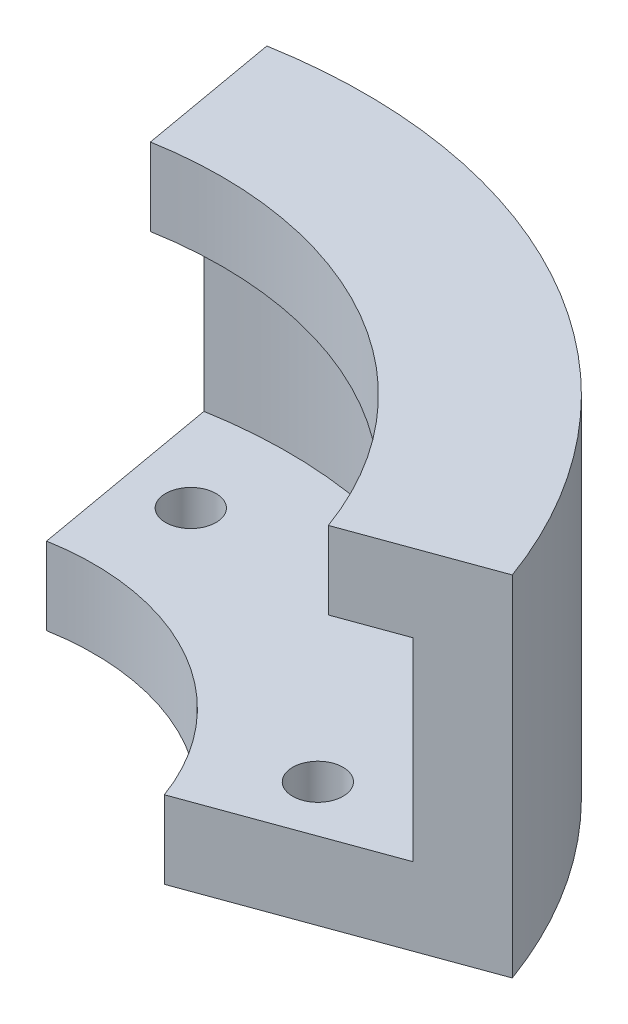
ISO-10303-21;
HEADER;
FILE_DESCRIPTION(('STEP AP214'),'2;1');
FILE_NAME('part.step','',(''),(''),'','','');
FILE_SCHEMA(('AUTOMOTIVE_DESIGN { 1 0 10303 214 1 1 1 1 }'));
ENDSEC;
DATA;
#1=APPLICATION_CONTEXT('core data for automotive mechanical design processes');
#2=APPLICATION_PROTOCOL_DEFINITION('international standard','automotive_design',2000,#1);
#3=PRODUCT_CONTEXT('',#1,'mechanical');
#4=PRODUCT('Part','Part','',(#3));
#5=PRODUCT_RELATED_PRODUCT_CATEGORY('part','',(#4));
#6=PRODUCT_DEFINITION_FORMATION('','',#4);
#7=PRODUCT_DEFINITION_CONTEXT('part definition',#1,'design');
#8=PRODUCT_DEFINITION('design','',#6,#7);
#9=PRODUCT_DEFINITION_SHAPE('','',#8);
#10=(LENGTH_UNIT() NAMED_UNIT(*) SI_UNIT(.MILLI.,.METRE.));
#11=(NAMED_UNIT(*) PLANE_ANGLE_UNIT() SI_UNIT($,.RADIAN.));
#12=(NAMED_UNIT(*) SI_UNIT($,.STERADIAN.) SOLID_ANGLE_UNIT());
#13=UNCERTAINTY_MEASURE_WITH_UNIT(LENGTH_MEASURE(1.E-05),#10,'distance_accuracy_value','');
#14=(GEOMETRIC_REPRESENTATION_CONTEXT(3) GLOBAL_UNCERTAINTY_ASSIGNED_CONTEXT((#13)) GLOBAL_UNIT_ASSIGNED_CONTEXT((#10,
#11,#12)) REPRESENTATION_CONTEXT('',''));
#15=CARTESIAN_POINT('',(0.,0.,0.));
#16=DIRECTION('',(0.,0.,1.));
#17=DIRECTION('',(1.,0.,0.));
#18=AXIS2_PLACEMENT_3D('',#15,#16,#17);
#19=CARTESIAN_POINT('',(0.,12.7,0.));
#20=DIRECTION('',(-0.342020143325673,0.,-0.939692620785907));
#21=DIRECTION('',(-0.939692620785907,0.,0.342020143325673));
#22=AXIS2_PLACEMENT_3D('',#19,#20,#21);
#23=PLANE('',#22);
#24=DIRECTION('',(0.939692620785907,0.,-0.342020143325673));
#25=VECTOR('',#24,1.);
#26=CARTESIAN_POINT('',(0.,17.78,0.));
#27=LINE('',#26,#25);
#28=CARTESIAN_POINT('',(23.271487753763,17.78,-8.47012884946029));
#29=VERTEX_POINT('',#28);
#30=CARTESIAN_POINT('',(32.1027190039089,17.78,-11.684434156435));
#31=VERTEX_POINT('',#30);
#32=EDGE_CURVE('E125',#29,#31,#27,.T.);
#33=ORIENTED_EDGE('',*,*,#32,.F.);
#34=DIRECTION('',(0.,1.,0.));
#35=VECTOR('',#34,1.);
#36=CARTESIAN_POINT('',(23.271487753763,-57.3459977443394,-8.47012884946029));
#37=LINE('',#36,#35);
#38=CARTESIAN_POINT('',(23.271487753763,12.7,-8.47012884946029));
#39=VERTEX_POINT('',#38);
#40=EDGE_CURVE('E110',#29,#39,#37,.F.);
#41=ORIENTED_EDGE('',*,*,#40,.T.);
#42=DIRECTION('',(0.939692620785907,0.,-0.342020143325673));
#43=VECTOR('',#42,1.);
#44=CARTESIAN_POINT('',(0.,12.7,0.));
#45=LINE('',#44,#43);
#46=CARTESIAN_POINT('',(27.3290804903165,12.7,-9.94697182834054));
#47=VERTEX_POINT('',#46);
#48=EDGE_CURVE('E122',#39,#47,#45,.T.);
#49=ORIENTED_EDGE('',*,*,#48,.T.);
#50=DIRECTION('',(0.,-1.,0.));
#51=VECTOR('',#50,1.);
#52=CARTESIAN_POINT('',(27.3290804903165,12.7,-9.94697182834054));
#53=LINE('',#52,#51);
#54=CARTESIAN_POINT('',(27.3290804903165,0.,-9.94697182834054));
#55=VERTEX_POINT('',#54);
#56=EDGE_CURVE('E161',#47,#55,#53,.T.);
#57=ORIENTED_EDGE('',*,*,#56,.T.);
#58=DIRECTION('',(0.939692620785907,0.,-0.342020143325673));
#59=VECTOR('',#58,1.);
#60=CARTESIAN_POINT('',(0.,0.,0.));
#61=LINE('',#60,#59);
#62=CARTESIAN_POINT('',(15.3949842063355,0.,-5.60331600810449));
#63=VERTEX_POINT('',#62);
#64=EDGE_CURVE('E149',#63,#55,#61,.T.);
#65=ORIENTED_EDGE('',*,*,#64,.F.);
#66=DIRECTION('',(0.,-1.,0.));
#67=VECTOR('',#66,1.);
#68=CARTESIAN_POINT('',(15.3949842063355,12.7,-5.60331600810449));
#69=LINE('',#68,#67);
#70=CARTESIAN_POINT('',(15.3949842063355,-5.08,-5.60331600810449));
#71=VERTEX_POINT('',#70);
#72=EDGE_CURVE('E165',#63,#71,#69,.T.);
#73=ORIENTED_EDGE('',*,*,#72,.T.);
#74=DIRECTION('',(0.939692620785907,0.,-0.342020143325673));
#75=VECTOR('',#74,1.);
#76=CARTESIAN_POINT('',(0.,-5.08,0.));
#77=LINE('',#76,#75);
#78=CARTESIAN_POINT('',(32.1027190039089,-5.08,-11.684434156435));
#79=VERTEX_POINT('',#78);
#80=EDGE_CURVE('E164',#71,#79,#77,.T.);
#81=ORIENTED_EDGE('',*,*,#80,.T.);
#82=DIRECTION('',(0.,-1.,0.));
#83=VECTOR('',#82,1.);
#84=CARTESIAN_POINT('',(32.1027190039089,17.78,-11.684434156435));
#85=LINE('',#84,#83);
#86=EDGE_CURVE('E11',#31,#79,#85,.T.);
#87=ORIENTED_EDGE('',*,*,#86,.F.);
#88=EDGE_LOOP('',(#33,#41,#49,#57,#65,#73,#81,#87));
#89=FACE_BOUND('',#88,.T.);
#90=ADVANCED_FACE('F41',(#89),#23,.F.);
#91=CARTESIAN_POINT('',(0.,12.7,0.));
#92=DIRECTION('',(0.984807753012208,0.,-0.173648177666931));
#93=DIRECTION('',(-0.173648177666931,0.,-0.984807753012208));
#94=AXIS2_PLACEMENT_3D('',#91,#92,#93);
#95=PLANE('',#94);
#96=DIRECTION('',(0.173648177666931,0.,0.984807753012208));
#97=VECTOR('',#96,1.);
#98=CARTESIAN_POINT('',(0.,12.7,0.));
#99=LINE('',#98,#97);
#100=CARTESIAN_POINT('',(-5.05020995108737,12.7,-28.641163880854));
#101=VERTEX_POINT('',#100);
#102=CARTESIAN_POINT('',(-4.30039711992155,12.7,-24.3887640033473));
#103=VERTEX_POINT('',#102);
#104=EDGE_CURVE('E137',#101,#103,#99,.T.);
#105=ORIENTED_EDGE('',*,*,#104,.T.);
#106=DIRECTION('',(0.,1.,0.));
#107=VECTOR('',#106,1.);
#108=CARTESIAN_POINT('',(-4.30039711992155,-57.3459977443394,-24.3887640033473));
#109=LINE('',#108,#107);
#110=CARTESIAN_POINT('',(-4.30039711992155,17.78,-24.3887640033473));
#111=VERTEX_POINT('',#110);
#112=EDGE_CURVE('E59',#103,#111,#109,.T.);
#113=ORIENTED_EDGE('',*,*,#112,.T.);
#114=DIRECTION('',(0.173648177666931,0.,0.984807753012208));
#115=VECTOR('',#114,1.);
#116=CARTESIAN_POINT('',(0.,17.78,0.));
#117=LINE('',#116,#115);
#118=CARTESIAN_POINT('',(-5.93234269363538,17.78,-33.6439872661561));
#119=VERTEX_POINT('',#118);
#120=EDGE_CURVE('E45',#119,#111,#117,.T.);
#121=ORIENTED_EDGE('',*,*,#120,.F.);
#122=DIRECTION('',(0.,-1.,0.));
#123=VECTOR('',#122,1.);
#124=CARTESIAN_POINT('',(-5.93234269363538,17.78,-33.6439872661561));
#125=LINE('',#124,#123);
#126=CARTESIAN_POINT('',(-5.93234269363538,-5.08,-33.6439872661561));
#127=VERTEX_POINT('',#126);
#128=EDGE_CURVE('E51',#119,#127,#125,.T.);
#129=ORIENTED_EDGE('',*,*,#128,.T.);
#130=DIRECTION('',(0.173648177666931,0.,0.984807753012208));
#131=VECTOR('',#130,1.);
#132=CARTESIAN_POINT('',(0.,-5.08,0.));
#133=LINE('',#132,#131);
#134=CARTESIAN_POINT('',(-2.84487809471734,-5.08,-16.134105417599));
#135=VERTEX_POINT('',#134);
#136=EDGE_CURVE('E174',#127,#135,#133,.T.);
#137=ORIENTED_EDGE('',*,*,#136,.T.);
#138=DIRECTION('',(0.,-1.,0.));
#139=VECTOR('',#138,1.);
#140=CARTESIAN_POINT('',(-2.84487809471734,12.7,-16.134105417599));
#141=LINE('',#140,#139);
#142=CARTESIAN_POINT('',(-2.84487809471734,0.,-16.134105417599));
#143=VERTEX_POINT('',#142);
#144=EDGE_CURVE('E168',#143,#135,#141,.T.);
#145=ORIENTED_EDGE('',*,*,#144,.F.);
#146=DIRECTION('',(0.173648177666931,0.,0.984807753012208));
#147=VECTOR('',#146,1.);
#148=CARTESIAN_POINT('',(0.,0.,0.));
#149=LINE('',#148,#147);
#150=CARTESIAN_POINT('',(-5.05020995108737,0.,-28.641163880854));
#151=VERTEX_POINT('',#150);
#152=EDGE_CURVE('E140',#151,#143,#149,.T.);
#153=ORIENTED_EDGE('',*,*,#152,.F.);
#154=DIRECTION('',(0.,-1.,0.));
#155=VECTOR('',#154,1.);
#156=CARTESIAN_POINT('',(-5.05020995108737,12.7,-28.641163880854));
#157=LINE('',#156,#155);
#158=EDGE_CURVE('E148',#101,#151,#157,.T.);
#159=ORIENTED_EDGE('',*,*,#158,.F.);
#160=EDGE_LOOP('',(#105,#113,#121,#129,#137,#145,#153,#159));
#161=FACE_BOUND('',#160,.T.);
#162=ADVANCED_FACE('F205',(#161),#95,.F.);
#163=CARTESIAN_POINT('',(0.,12.7,0.));
#164=DIRECTION('',(0.,-1.,0.));
#165=DIRECTION('',(0.,0.,-1.));
#166=AXIS2_PLACEMENT_3D('',#163,#164,#165);
#167=CYLINDRICAL_SURFACE('',#166,16.383);
#168=ORIENTED_EDGE('',*,*,#72,.F.);
#169=CARTESIAN_POINT('',(0.,0.,0.));
#170=DIRECTION('',(0.,1.,0.));
#171=DIRECTION('',(0.,0.,1.));
#172=AXIS2_PLACEMENT_3D('',#169,#170,#171);
#173=CIRCLE('',#172,16.383);
#174=EDGE_CURVE('E133',#63,#143,#173,.T.);
#175=ORIENTED_EDGE('',*,*,#174,.T.);
#176=ORIENTED_EDGE('',*,*,#144,.T.);
#177=CARTESIAN_POINT('',(0.,-5.08,0.));
#178=DIRECTION('',(0.,1.,0.));
#179=DIRECTION('',(0.,0.,1.));
#180=AXIS2_PLACEMENT_3D('',#177,#178,#179);
#181=CIRCLE('',#180,16.383);
#182=EDGE_CURVE('E183',#71,#135,#181,.T.);
#183=ORIENTED_EDGE('',*,*,#182,.F.);
#184=EDGE_LOOP('',(#168,#175,#176,#183));
#185=FACE_BOUND('',#184,.T.);
#186=ADVANCED_FACE('F201',(#185),#167,.F.);
#187=CARTESIAN_POINT('',(0.,12.7,0.));
#188=DIRECTION('',(0.,-1.,0.));
#189=DIRECTION('',(0.,0.,-1.));
#190=AXIS2_PLACEMENT_3D('',#187,#188,#189);
#191=CYLINDRICAL_SURFACE('',#190,34.163);
#192=CARTESIAN_POINT('',(0.,-5.08,0.));
#193=DIRECTION('',(0.,1.,0.));
#194=DIRECTION('',(0.,0.,1.));
#195=AXIS2_PLACEMENT_3D('',#192,#193,#194);
#196=CIRCLE('',#195,34.163);
#197=EDGE_CURVE('E171',#79,#127,#196,.T.);
#198=ORIENTED_EDGE('',*,*,#197,.T.);
#199=ORIENTED_EDGE('',*,*,#128,.F.);
#200=CARTESIAN_POINT('',(0.,17.78,0.));
#201=DIRECTION('',(0.,1.,0.));
#202=DIRECTION('',(0.,0.,1.));
#203=AXIS2_PLACEMENT_3D('',#200,#201,#202);
#204=CIRCLE('',#203,34.163);
#205=EDGE_CURVE('E67',#31,#119,#204,.T.);
#206=ORIENTED_EDGE('',*,*,#205,.F.);
#207=ORIENTED_EDGE('',*,*,#86,.T.);
#208=EDGE_LOOP('',(#198,#199,#206,#207));
#209=FACE_BOUND('',#208,.T.);
#210=ADVANCED_FACE('F192',(#209),#191,.T.);
#211=CARTESIAN_POINT('',(0.,17.78,0.));
#212=DIRECTION('',(0.,1.,0.));
#213=DIRECTION('',(0.,0.,1.));
#214=AXIS2_PLACEMENT_3D('',#211,#212,#213);
#215=PLANE('',#214);
#216=CARTESIAN_POINT('',(0.,17.78,0.));
#217=DIRECTION('',(0.,1.,0.));
#218=DIRECTION('',(0.,0.,1.));
#219=AXIS2_PLACEMENT_3D('',#216,#217,#218);
#220=CIRCLE('',#219,24.765);
#221=EDGE_CURVE('E117',#29,#111,#220,.T.);
#222=ORIENTED_EDGE('',*,*,#221,.F.);
#223=ORIENTED_EDGE('',*,*,#32,.T.);
#224=ORIENTED_EDGE('',*,*,#205,.T.);
#225=ORIENTED_EDGE('',*,*,#120,.T.);
#226=EDGE_LOOP('',(#222,#223,#224,#225));
#227=FACE_BOUND('',#226,.T.);
#228=ADVANCED_FACE('F190',(#227),#215,.T.);
#229=CARTESIAN_POINT('',(0.,-5.08,0.));
#230=DIRECTION('',(0.,1.,0.));
#231=DIRECTION('',(0.,0.,1.));
#232=AXIS2_PLACEMENT_3D('',#229,#230,#231);
#233=PLANE('',#232);
#234=CARTESIAN_POINT('',(0.,-5.08,-22.733));
#235=DIRECTION('',(0.,1.,0.));
#236=DIRECTION('',(0.,0.,1.));
#237=AXIS2_PLACEMENT_3D('',#234,#235,#236);
#238=CIRCLE('',#237,1.651);
#239=CARTESIAN_POINT('',(0.,-5.08,-21.082));
#240=VERTEX_POINT('',#239);
#241=EDGE_CURVE('E143',#240,#240,#238,.T.);
#242=ORIENTED_EDGE('',*,*,#241,.T.);
#243=EDGE_LOOP('',(#242));
#244=FACE_BOUND('',#243,.T.);
#245=CARTESIAN_POINT('',(19.6873555042316,-5.08,-11.3665000000001));
#246=DIRECTION('',(0.,1.,0.));
#247=DIRECTION('',(0.,0.,1.));
#248=AXIS2_PLACEMENT_3D('',#245,#246,#247);
#249=CIRCLE('',#248,1.651);
#250=CARTESIAN_POINT('',(19.6873555042316,-5.08,-9.7155000000001));
#251=VERTEX_POINT('',#250);
#252=EDGE_CURVE('E216',#251,#251,#249,.T.);
#253=ORIENTED_EDGE('',*,*,#252,.T.);
#254=EDGE_LOOP('',(#253));
#255=FACE_BOUND('',#254,.T.);
#256=ORIENTED_EDGE('',*,*,#80,.F.);
#257=ORIENTED_EDGE('',*,*,#182,.T.);
#258=ORIENTED_EDGE('',*,*,#136,.F.);
#259=ORIENTED_EDGE('',*,*,#197,.F.);
#260=EDGE_LOOP('',(#256,#257,#258,#259));
#261=FACE_BOUND('',#260,.T.);
#262=ADVANCED_FACE('F43',(#244,#255,#261),#233,.F.);
#263=CARTESIAN_POINT('',(0.,12.7,0.));
#264=DIRECTION('',(0.,-1.,0.));
#265=DIRECTION('',(0.,0.,-1.));
#266=AXIS2_PLACEMENT_3D('',#263,#264,#265);
#267=CYLINDRICAL_SURFACE('',#266,29.083);
#268=CARTESIAN_POINT('',(0.,0.,0.));
#269=DIRECTION('',(0.,1.,0.));
#270=DIRECTION('',(0.,0.,1.));
#271=AXIS2_PLACEMENT_3D('',#268,#269,#270);
#272=CIRCLE('',#271,29.083);
#273=EDGE_CURVE('E153',#55,#151,#272,.T.);
#274=ORIENTED_EDGE('',*,*,#273,.F.);
#275=ORIENTED_EDGE('',*,*,#56,.F.);
#276=CARTESIAN_POINT('',(0.,12.7,0.));
#277=DIRECTION('',(0.,1.,0.));
#278=DIRECTION('',(0.,0.,1.));
#279=AXIS2_PLACEMENT_3D('',#276,#277,#278);
#280=CIRCLE('',#279,29.083);
#281=EDGE_CURVE('E130',#47,#101,#280,.T.);
#282=ORIENTED_EDGE('',*,*,#281,.T.);
#283=ORIENTED_EDGE('',*,*,#158,.T.);
#284=EDGE_LOOP('',(#274,#275,#282,#283));
#285=FACE_BOUND('',#284,.T.);
#286=ADVANCED_FACE('F254',(#285),#267,.F.);
#287=CARTESIAN_POINT('',(0.,12.7,0.));
#288=DIRECTION('',(0.,1.,0.));
#289=DIRECTION('',(0.,0.,1.));
#290=AXIS2_PLACEMENT_3D('',#287,#288,#289);
#291=PLANE('',#290);
#292=ORIENTED_EDGE('',*,*,#48,.F.);
#293=CARTESIAN_POINT('',(0.,12.7,0.));
#294=DIRECTION('',(0.,1.,0.));
#295=DIRECTION('',(0.,0.,1.));
#296=AXIS2_PLACEMENT_3D('',#293,#294,#295);
#297=CIRCLE('',#296,24.765);
#298=EDGE_CURVE('E107',#103,#39,#297,.F.);
#299=ORIENTED_EDGE('',*,*,#298,.F.);
#300=ORIENTED_EDGE('',*,*,#104,.F.);
#301=ORIENTED_EDGE('',*,*,#281,.F.);
#302=EDGE_LOOP('',(#292,#299,#300,#301));
#303=FACE_BOUND('',#302,.T.);
#304=ADVANCED_FACE('F129',(#303),#291,.F.);
#305=CARTESIAN_POINT('',(0.,0.,0.));
#306=DIRECTION('',(0.,1.,0.));
#307=DIRECTION('',(0.,0.,1.));
#308=AXIS2_PLACEMENT_3D('',#305,#306,#307);
#309=PLANE('',#308);
#310=CARTESIAN_POINT('',(0.,0.,-22.733));
#311=DIRECTION('',(0.,1.,0.));
#312=DIRECTION('',(0.,0.,1.));
#313=AXIS2_PLACEMENT_3D('',#310,#311,#312);
#314=CIRCLE('',#313,1.651);
#315=CARTESIAN_POINT('',(0.,0.,-21.082));
#316=VERTEX_POINT('',#315);
#317=EDGE_CURVE('E212',#316,#316,#314,.T.);
#318=ORIENTED_EDGE('',*,*,#317,.F.);
#319=EDGE_LOOP('',(#318));
#320=FACE_BOUND('',#319,.T.);
#321=CARTESIAN_POINT('',(19.6873555042316,0.,-11.3665000000001));
#322=DIRECTION('',(0.,1.,0.));
#323=DIRECTION('',(0.,0.,1.));
#324=AXIS2_PLACEMENT_3D('',#321,#322,#323);
#325=CIRCLE('',#324,1.651);
#326=CARTESIAN_POINT('',(19.6873555042316,0.,-9.7155000000001));
#327=VERTEX_POINT('',#326);
#328=EDGE_CURVE('E127',#327,#327,#325,.T.);
#329=ORIENTED_EDGE('',*,*,#328,.F.);
#330=EDGE_LOOP('',(#329));
#331=FACE_BOUND('',#330,.T.);
#332=ORIENTED_EDGE('',*,*,#64,.T.);
#333=ORIENTED_EDGE('',*,*,#273,.T.);
#334=ORIENTED_EDGE('',*,*,#152,.T.);
#335=ORIENTED_EDGE('',*,*,#174,.F.);
#336=EDGE_LOOP('',(#332,#333,#334,#335));
#337=FACE_BOUND('',#336,.T.);
#338=ADVANCED_FACE('F238',(#320,#331,#337),#309,.T.);
#339=CARTESIAN_POINT('',(19.6873555042316,-12.192,-11.3665000000001));
#340=DIRECTION('',(0.,1.,0.));
#341=DIRECTION('',(0.,0.,1.));
#342=AXIS2_PLACEMENT_3D('',#339,#340,#341);
#343=CYLINDRICAL_SURFACE('',#342,1.651);
#344=CARTESIAN_POINT('',(19.6873555042316,0.,-9.7155000000001));
#345=CARTESIAN_POINT('',(19.6873555042316,-0.0529166666666664,-9.7155000000001));
#346=CARTESIAN_POINT('',(19.6873555042316,-0.105833333333333,-9.7155000000001));
#347=CARTESIAN_POINT('',(19.6873555042316,-0.211666666666666,-9.7155000000001));
#348=CARTESIAN_POINT('',(19.6873555042316,-0.264583333333333,-9.7155000000001));
#349=CARTESIAN_POINT('',(19.6873555042316,-0.370416666666667,-9.7155000000001));
#350=CARTESIAN_POINT('',(19.6873555042316,-0.423333333333334,-9.7155000000001));
#351=CARTESIAN_POINT('',(19.6873555042316,-0.529166666666667,-9.7155000000001));
#352=CARTESIAN_POINT('',(19.6873555042316,-0.582083333333334,-9.7155000000001));
#353=CARTESIAN_POINT('',(19.6873555042316,-0.687916666666667,-9.7155000000001));
#354=CARTESIAN_POINT('',(19.6873555042316,-0.740833333333333,-9.7155000000001));
#355=CARTESIAN_POINT('',(19.6873555042316,-0.846666666666666,-9.7155000000001));
#356=CARTESIAN_POINT('',(19.6873555042316,-0.899583333333333,-9.7155000000001));
#357=CARTESIAN_POINT('',(19.6873555042316,-1.00541666666667,-9.7155000000001));
#358=CARTESIAN_POINT('',(19.6873555042316,-1.05833333333333,-9.7155000000001));
#359=CARTESIAN_POINT('',(19.6873555042316,-1.16416666666667,-9.7155000000001));
#360=CARTESIAN_POINT('',(19.6873555042316,-1.21708333333333,-9.7155000000001));
#361=CARTESIAN_POINT('',(19.6873555042316,-1.32291666666667,-9.7155000000001));
#362=CARTESIAN_POINT('',(19.6873555042316,-1.37583333333333,-9.7155000000001));
#363=CARTESIAN_POINT('',(19.6873555042316,-1.48166666666667,-9.7155000000001));
#364=CARTESIAN_POINT('',(19.6873555042316,-1.53458333333333,-9.7155000000001));
#365=CARTESIAN_POINT('',(19.6873555042316,-1.64041666666667,-9.7155000000001));
#366=CARTESIAN_POINT('',(19.6873555042316,-1.69333333333333,-9.7155000000001));
#367=CARTESIAN_POINT('',(19.6873555042316,-1.79916666666667,-9.7155000000001));
#368=CARTESIAN_POINT('',(19.6873555042316,-1.85208333333333,-9.7155000000001));
#369=CARTESIAN_POINT('',(19.6873555042316,-1.95791666666667,-9.7155000000001));
#370=CARTESIAN_POINT('',(19.6873555042316,-2.01083333333333,-9.7155000000001));
#371=CARTESIAN_POINT('',(19.6873555042316,-2.11666666666667,-9.7155000000001));
#372=CARTESIAN_POINT('',(19.6873555042316,-2.16958333333333,-9.7155000000001));
#373=CARTESIAN_POINT('',(19.6873555042316,-2.27541666666667,-9.7155000000001));
#374=CARTESIAN_POINT('',(19.6873555042316,-2.32833333333333,-9.7155000000001));
#375=CARTESIAN_POINT('',(19.6873555042316,-2.43416666666667,-9.7155000000001));
#376=CARTESIAN_POINT('',(19.6873555042316,-2.48708333333333,-9.7155000000001));
#377=CARTESIAN_POINT('',(19.6873555042316,-2.59291666666667,-9.7155000000001));
#378=CARTESIAN_POINT('',(19.6873555042316,-2.64583333333333,-9.7155000000001));
#379=CARTESIAN_POINT('',(19.6873555042316,-2.75166666666667,-9.7155000000001));
#380=CARTESIAN_POINT('',(19.6873555042316,-2.80458333333333,-9.7155000000001));
#381=CARTESIAN_POINT('',(19.6873555042316,-2.91041666666667,-9.7155000000001));
#382=CARTESIAN_POINT('',(19.6873555042316,-2.96333333333333,-9.7155000000001));
#383=CARTESIAN_POINT('',(19.6873555042316,-3.06916666666667,-9.7155000000001));
#384=CARTESIAN_POINT('',(19.6873555042316,-3.12208333333333,-9.7155000000001));
#385=CARTESIAN_POINT('',(19.6873555042316,-3.22791666666667,-9.7155000000001));
#386=CARTESIAN_POINT('',(19.6873555042316,-3.28083333333333,-9.7155000000001));
#387=CARTESIAN_POINT('',(19.6873555042316,-3.38666666666667,-9.7155000000001));
#388=CARTESIAN_POINT('',(19.6873555042316,-3.43958333333333,-9.7155000000001));
#389=CARTESIAN_POINT('',(19.6873555042316,-3.54541666666667,-9.7155000000001));
#390=CARTESIAN_POINT('',(19.6873555042316,-3.59833333333333,-9.7155000000001));
#391=CARTESIAN_POINT('',(19.6873555042316,-3.70416666666667,-9.7155000000001));
#392=CARTESIAN_POINT('',(19.6873555042316,-3.75708333333333,-9.7155000000001));
#393=CARTESIAN_POINT('',(19.6873555042316,-3.86291666666667,-9.7155000000001));
#394=CARTESIAN_POINT('',(19.6873555042316,-3.91583333333333,-9.7155000000001));
#395=CARTESIAN_POINT('',(19.6873555042316,-4.02166666666667,-9.7155000000001));
#396=CARTESIAN_POINT('',(19.6873555042316,-4.07458333333333,-9.7155000000001));
#397=CARTESIAN_POINT('',(19.6873555042316,-4.18041666666667,-9.7155000000001));
#398=CARTESIAN_POINT('',(19.6873555042316,-4.23333333333333,-9.7155000000001));
#399=CARTESIAN_POINT('',(19.6873555042316,-4.33916666666667,-9.7155000000001));
#400=CARTESIAN_POINT('',(19.6873555042316,-4.39208333333333,-9.7155000000001));
#401=CARTESIAN_POINT('',(19.6873555042316,-4.49791666666667,-9.7155000000001));
#402=CARTESIAN_POINT('',(19.6873555042316,-4.55083333333333,-9.7155000000001));
#403=CARTESIAN_POINT('',(19.6873555042316,-4.65666666666667,-9.7155000000001));
#404=CARTESIAN_POINT('',(19.6873555042316,-4.70958333333333,-9.7155000000001));
#405=CARTESIAN_POINT('',(19.6873555042316,-4.81541666666667,-9.7155000000001));
#406=CARTESIAN_POINT('',(19.6873555042316,-4.86833333333333,-9.7155000000001));
#407=CARTESIAN_POINT('',(19.6873555042316,-4.97416666666667,-9.7155000000001));
#408=CARTESIAN_POINT('',(19.6873555042316,-5.02708333333333,-9.7155000000001));
#409=CARTESIAN_POINT('',(19.6873555042316,-5.08,-9.7155000000001));
#410=B_SPLINE_CURVE_WITH_KNOTS('',3,(#344,#345,#346,#347,#348,#349,#350,#351,#352,#353,#354,
#355,#356,#357,#358,#359,#360,#361,#362,#363,#364,#365,#366,#367,#368,#369,#370,#371,#372,#373,
#374,#375,#376,#377,#378,#379,#380,#381,#382,#383,#384,#385,#386,#387,#388,#389,#390,#391,#392,
#393,#394,#395,#396,#397,#398,#399,#400,#401,#402,#403,#404,#405,#406,#407,#408,#409),
.UNSPECIFIED.,.F.,.F.,(4,2,2,2,2,2,2,2,2,2,2,2,2,2,2,2,2,2,2,2,2,2,2,2,2,2,2,2,2,2,2,2,4),(0.,
0.158749999999999,0.3175,0.476250000000001,0.635,0.793749999999999,0.9525,1.11125,1.27,1.42875,
1.5875,1.74625,1.905,2.06375,2.2225,2.38125,2.54,2.69875,2.8575,3.01625,3.175,3.33375,3.4925,
3.65125,3.81,3.96875,4.1275,4.28625,4.445,4.60375,4.7625,4.92125,5.08),.UNSPECIFIED.);
#411=EDGE_CURVE('BSEAM230',#327,#251,#410,.T.);
#412=ORIENTED_EDGE('',*,*,#328,.T.);
#413=ORIENTED_EDGE('',*,*,#252,.F.);
#414=ORIENTED_EDGE('',*,*,#411,.T.);
#415=ORIENTED_EDGE('',*,*,#411,.F.);
#416=EDGE_LOOP('',(#412,#414,#413,#415));
#417=FACE_BOUND('',#416,.T.);
#418=ADVANCED_FACE('F230',(#417),#343,.F.);
#419=CARTESIAN_POINT('',(0.,-12.192,-22.733));
#420=DIRECTION('',(0.,1.,0.));
#421=DIRECTION('',(0.,0.,1.));
#422=AXIS2_PLACEMENT_3D('',#419,#420,#421);
#423=CYLINDRICAL_SURFACE('',#422,1.651);
#424=CARTESIAN_POINT('',(0.,0.,-21.082));
#425=CARTESIAN_POINT('',(0.,-0.0529166666666664,-21.082));
#426=CARTESIAN_POINT('',(0.,-0.105833333333333,-21.082));
#427=CARTESIAN_POINT('',(0.,-0.211666666666666,-21.082));
#428=CARTESIAN_POINT('',(0.,-0.264583333333333,-21.082));
#429=CARTESIAN_POINT('',(0.,-0.370416666666667,-21.082));
#430=CARTESIAN_POINT('',(0.,-0.423333333333334,-21.082));
#431=CARTESIAN_POINT('',(0.,-0.529166666666667,-21.082));
#432=CARTESIAN_POINT('',(0.,-0.582083333333334,-21.082));
#433=CARTESIAN_POINT('',(0.,-0.687916666666667,-21.082));
#434=CARTESIAN_POINT('',(0.,-0.740833333333333,-21.082));
#435=CARTESIAN_POINT('',(0.,-0.846666666666666,-21.082));
#436=CARTESIAN_POINT('',(0.,-0.899583333333333,-21.082));
#437=CARTESIAN_POINT('',(0.,-1.00541666666667,-21.082));
#438=CARTESIAN_POINT('',(0.,-1.05833333333333,-21.082));
#439=CARTESIAN_POINT('',(0.,-1.16416666666667,-21.082));
#440=CARTESIAN_POINT('',(0.,-1.21708333333333,-21.082));
#441=CARTESIAN_POINT('',(0.,-1.32291666666667,-21.082));
#442=CARTESIAN_POINT('',(0.,-1.37583333333333,-21.082));
#443=CARTESIAN_POINT('',(0.,-1.48166666666667,-21.082));
#444=CARTESIAN_POINT('',(0.,-1.53458333333333,-21.082));
#445=CARTESIAN_POINT('',(0.,-1.64041666666667,-21.082));
#446=CARTESIAN_POINT('',(0.,-1.69333333333333,-21.082));
#447=CARTESIAN_POINT('',(0.,-1.79916666666667,-21.082));
#448=CARTESIAN_POINT('',(0.,-1.85208333333333,-21.082));
#449=CARTESIAN_POINT('',(0.,-1.95791666666667,-21.082));
#450=CARTESIAN_POINT('',(0.,-2.01083333333333,-21.082));
#451=CARTESIAN_POINT('',(0.,-2.11666666666667,-21.082));
#452=CARTESIAN_POINT('',(0.,-2.16958333333333,-21.082));
#453=CARTESIAN_POINT('',(0.,-2.27541666666667,-21.082));
#454=CARTESIAN_POINT('',(0.,-2.32833333333333,-21.082));
#455=CARTESIAN_POINT('',(0.,-2.43416666666667,-21.082));
#456=CARTESIAN_POINT('',(0.,-2.48708333333333,-21.082));
#457=CARTESIAN_POINT('',(0.,-2.59291666666667,-21.082));
#458=CARTESIAN_POINT('',(0.,-2.64583333333333,-21.082));
#459=CARTESIAN_POINT('',(0.,-2.75166666666667,-21.082));
#460=CARTESIAN_POINT('',(0.,-2.80458333333333,-21.082));
#461=CARTESIAN_POINT('',(0.,-2.91041666666667,-21.082));
#462=CARTESIAN_POINT('',(0.,-2.96333333333333,-21.082));
#463=CARTESIAN_POINT('',(0.,-3.06916666666667,-21.082));
#464=CARTESIAN_POINT('',(0.,-3.12208333333333,-21.082));
#465=CARTESIAN_POINT('',(0.,-3.22791666666667,-21.082));
#466=CARTESIAN_POINT('',(0.,-3.28083333333333,-21.082));
#467=CARTESIAN_POINT('',(0.,-3.38666666666667,-21.082));
#468=CARTESIAN_POINT('',(0.,-3.43958333333333,-21.082));
#469=CARTESIAN_POINT('',(0.,-3.54541666666667,-21.082));
#470=CARTESIAN_POINT('',(0.,-3.59833333333333,-21.082));
#471=CARTESIAN_POINT('',(0.,-3.70416666666667,-21.082));
#472=CARTESIAN_POINT('',(0.,-3.75708333333333,-21.082));
#473=CARTESIAN_POINT('',(0.,-3.86291666666667,-21.082));
#474=CARTESIAN_POINT('',(0.,-3.91583333333333,-21.082));
#475=CARTESIAN_POINT('',(0.,-4.02166666666667,-21.082));
#476=CARTESIAN_POINT('',(0.,-4.07458333333333,-21.082));
#477=CARTESIAN_POINT('',(0.,-4.18041666666667,-21.082));
#478=CARTESIAN_POINT('',(0.,-4.23333333333333,-21.082));
#479=CARTESIAN_POINT('',(0.,-4.33916666666667,-21.082));
#480=CARTESIAN_POINT('',(0.,-4.39208333333333,-21.082));
#481=CARTESIAN_POINT('',(0.,-4.49791666666667,-21.082));
#482=CARTESIAN_POINT('',(0.,-4.55083333333333,-21.082));
#483=CARTESIAN_POINT('',(0.,-4.65666666666667,-21.082));
#484=CARTESIAN_POINT('',(0.,-4.70958333333333,-21.082));
#485=CARTESIAN_POINT('',(0.,-4.81541666666667,-21.082));
#486=CARTESIAN_POINT('',(0.,-4.86833333333333,-21.082));
#487=CARTESIAN_POINT('',(0.,-4.97416666666667,-21.082));
#488=CARTESIAN_POINT('',(0.,-5.02708333333333,-21.082));
#489=CARTESIAN_POINT('',(0.,-5.08,-21.082));
#490=B_SPLINE_CURVE_WITH_KNOTS('',3,(#424,#425,#426,#427,#428,#429,#430,#431,#432,#433,#434,
#435,#436,#437,#438,#439,#440,#441,#442,#443,#444,#445,#446,#447,#448,#449,#450,#451,#452,#453,
#454,#455,#456,#457,#458,#459,#460,#461,#462,#463,#464,#465,#466,#467,#468,#469,#470,#471,#472,
#473,#474,#475,#476,#477,#478,#479,#480,#481,#482,#483,#484,#485,#486,#487,#488,#489),
.UNSPECIFIED.,.F.,.F.,(4,2,2,2,2,2,2,2,2,2,2,2,2,2,2,2,2,2,2,2,2,2,2,2,2,2,2,2,2,2,2,2,4),(0.,
0.158749999999999,0.3175,0.476250000000001,0.635,0.793749999999999,0.9525,1.11125,1.27,1.42875,
1.5875,1.74625,1.905,2.06375,2.2225,2.38125,2.54,2.69875,2.8575,3.01625,3.175,3.33375,3.4925,
3.65125,3.81,3.96875,4.1275,4.28625,4.445,4.60375,4.7625,4.92125,5.08),.UNSPECIFIED.);
#491=EDGE_CURVE('BSEAM228',#316,#240,#490,.T.);
#492=ORIENTED_EDGE('',*,*,#317,.T.);
#493=ORIENTED_EDGE('',*,*,#241,.F.);
#494=ORIENTED_EDGE('',*,*,#491,.T.);
#495=ORIENTED_EDGE('',*,*,#491,.F.);
#496=EDGE_LOOP('',(#492,#494,#493,#495));
#497=FACE_BOUND('',#496,.T.);
#498=ADVANCED_FACE('F228',(#497),#423,.F.);
#499=CARTESIAN_POINT('',(0.,-57.3459977443394,0.));
#500=DIRECTION('',(0.,1.,0.));
#501=DIRECTION('',(0.,0.,1.));
#502=AXIS2_PLACEMENT_3D('',#499,#500,#501);
#503=CYLINDRICAL_SURFACE('',#502,24.765);
#504=ORIENTED_EDGE('',*,*,#221,.T.);
#505=ORIENTED_EDGE('',*,*,#112,.F.);
#506=ORIENTED_EDGE('',*,*,#298,.T.);
#507=ORIENTED_EDGE('',*,*,#40,.F.);
#508=EDGE_LOOP('',(#504,#505,#506,#507));
#509=FACE_BOUND('',#508,.T.);
#510=ADVANCED_FACE('F109',(#509),#503,.F.);
#511=CLOSED_SHELL('',(#90,#162,#186,#210,#228,#262,#286,#304,#338,#418,#498,#510));
#512=MANIFOLD_SOLID_BREP('B2',#511);
#513=ADVANCED_BREP_SHAPE_REPRESENTATION('',(#18,#512),#14);
#514=SHAPE_DEFINITION_REPRESENTATION(#9,#513);
ENDSEC;
END-ISO-10303-21;
